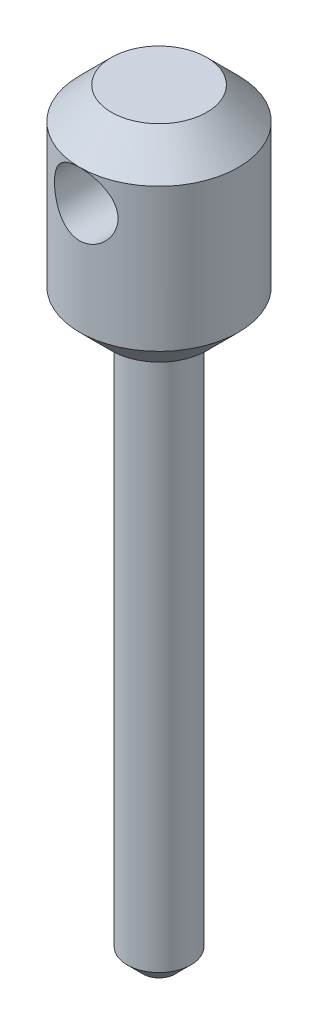
ISO-10303-21;
HEADER;
FILE_DESCRIPTION(('STEP AP214'),'2;1');
FILE_NAME('part.step','',(''),(''),'','','');
FILE_SCHEMA(('AUTOMOTIVE_DESIGN { 1 0 10303 214 1 1 1 1 }'));
ENDSEC;
DATA;
#1=APPLICATION_CONTEXT('core data for automotive mechanical design processes');
#2=APPLICATION_PROTOCOL_DEFINITION('international standard','automotive_design',2000,#1);
#3=PRODUCT_CONTEXT('',#1,'mechanical');
#4=PRODUCT('Part','Part','',(#3));
#5=PRODUCT_RELATED_PRODUCT_CATEGORY('part','',(#4));
#6=PRODUCT_DEFINITION_FORMATION('','',#4);
#7=PRODUCT_DEFINITION_CONTEXT('part definition',#1,'design');
#8=PRODUCT_DEFINITION('design','',#6,#7);
#9=PRODUCT_DEFINITION_SHAPE('','',#8);
#10=(LENGTH_UNIT() NAMED_UNIT(*) SI_UNIT(.MILLI.,.METRE.));
#11=(NAMED_UNIT(*) PLANE_ANGLE_UNIT() SI_UNIT($,.RADIAN.));
#12=(NAMED_UNIT(*) SI_UNIT($,.STERADIAN.) SOLID_ANGLE_UNIT());
#13=UNCERTAINTY_MEASURE_WITH_UNIT(LENGTH_MEASURE(1.E-05),#10,'distance_accuracy_value','');
#14=(GEOMETRIC_REPRESENTATION_CONTEXT(3) GLOBAL_UNCERTAINTY_ASSIGNED_CONTEXT((#13)) GLOBAL_UNIT_ASSIGNED_CONTEXT((#10,
#11,#12)) REPRESENTATION_CONTEXT('',''));
#15=CARTESIAN_POINT('',(0.,0.,0.));
#16=DIRECTION('',(0.,0.,1.));
#17=DIRECTION('',(1.,0.,0.));
#18=AXIS2_PLACEMENT_3D('',#15,#16,#17);
#19=CARTESIAN_POINT('',(0.,0.,0.));
#20=DIRECTION('',(0.,-1.,0.));
#21=DIRECTION('',(0.,0.,-1.));
#22=AXIS2_PLACEMENT_3D('',#19,#20,#21);
#23=PLANE('',#22);
#24=CARTESIAN_POINT('',(0.,0.,0.));
#25=DIRECTION('',(0.,-1.,0.));
#26=DIRECTION('',(0.,0.,-1.));
#27=AXIS2_PLACEMENT_3D('',#24,#25,#26);
#28=CIRCLE('',#27,1.);
#29=CARTESIAN_POINT('',(0.,0.,-1.));
#30=VERTEX_POINT('',#29);
#31=EDGE_CURVE('E11',#30,#30,#28,.T.);
#32=ORIENTED_EDGE('',*,*,#31,.T.);
#33=EDGE_LOOP('',(#32));
#34=FACE_BOUND('',#33,.T.);
#35=ADVANCED_FACE('F37',(#34),#23,.T.);
#36=CARTESIAN_POINT('',(0.,0.,0.));
#37=DIRECTION('',(0.,1.,0.));
#38=DIRECTION('',(0.,0.,1.));
#39=AXIS2_PLACEMENT_3D('',#36,#37,#38);
#40=CONICAL_SURFACE('',#39,1.,0.78539816339745);
#41=CARTESIAN_POINT('',(0.,0.999999999999997,0.));
#42=DIRECTION('',(0.,-1.,0.));
#43=DIRECTION('',(0.,0.,-1.));
#44=AXIS2_PLACEMENT_3D('',#41,#42,#43);
#45=CIRCLE('',#44,2.);
#46=CARTESIAN_POINT('',(0.,0.999999999999997,-2.));
#47=VERTEX_POINT('',#46);
#48=EDGE_CURVE('E44',#47,#47,#45,.T.);
#49=ORIENTED_EDGE('',*,*,#48,.T.);
#50=EDGE_LOOP('',(#49));
#51=FACE_BOUND('',#50,.T.);
#52=ORIENTED_EDGE('',*,*,#31,.F.);
#53=EDGE_LOOP('',(#52));
#54=FACE_BOUND('',#53,.T.);
#55=ADVANCED_FACE('F92',(#51,#54),#40,.T.);
#56=CARTESIAN_POINT('',(0.,0.,0.));
#57=DIRECTION('',(0.,-1.,0.));
#58=DIRECTION('',(0.,0.,-1.));
#59=AXIS2_PLACEMENT_3D('',#56,#57,#58);
#60=CYLINDRICAL_SURFACE('',#59,2.);
#61=CARTESIAN_POINT('',(0.,35.,0.));
#62=DIRECTION('',(0.,-1.,0.));
#63=DIRECTION('',(0.,0.,-1.));
#64=AXIS2_PLACEMENT_3D('',#61,#62,#63);
#65=CIRCLE('',#64,2.);
#66=CARTESIAN_POINT('',(0.,35.,-2.));
#67=VERTEX_POINT('',#66);
#68=EDGE_CURVE('E122',#67,#67,#65,.T.);
#69=ORIENTED_EDGE('',*,*,#68,.T.);
#70=EDGE_LOOP('',(#69));
#71=FACE_BOUND('',#70,.T.);
#72=ORIENTED_EDGE('',*,*,#48,.F.);
#73=EDGE_LOOP('',(#72));
#74=FACE_BOUND('',#73,.T.);
#75=ADVANCED_FACE('F97',(#71,#74),#60,.T.);
#76=CARTESIAN_POINT('',(2.,35.,0.));
#77=DIRECTION('',(0.,-1.,0.));
#78=DIRECTION('',(0.,0.,-1.));
#79=AXIS2_PLACEMENT_3D('',#76,#77,#78);
#80=PLANE('',#79);
#81=CARTESIAN_POINT('',(0.,35.,0.));
#82=DIRECTION('',(0.,-1.,0.));
#83=DIRECTION('',(0.,0.,-1.));
#84=AXIS2_PLACEMENT_3D('',#81,#82,#83);
#85=CIRCLE('',#84,3.);
#86=CARTESIAN_POINT('',(0.,35.,-3.));
#87=VERTEX_POINT('',#86);
#88=EDGE_CURVE('E121',#87,#87,#85,.T.);
#89=ORIENTED_EDGE('',*,*,#88,.T.);
#90=EDGE_LOOP('',(#89));
#91=FACE_BOUND('',#90,.T.);
#92=ORIENTED_EDGE('',*,*,#68,.F.);
#93=EDGE_LOOP('',(#92));
#94=FACE_BOUND('',#93,.T.);
#95=ADVANCED_FACE('F104',(#91,#94),#80,.T.);
#96=CARTESIAN_POINT('',(0.,35.,0.));
#97=DIRECTION('',(0.,1.,0.));
#98=DIRECTION('',(0.,0.,1.));
#99=AXIS2_PLACEMENT_3D('',#96,#97,#98);
#100=CONICAL_SURFACE('',#99,3.,0.78539816339745);
#101=CARTESIAN_POINT('',(0.,37.,0.));
#102=DIRECTION('',(0.,-1.,0.));
#103=DIRECTION('',(0.,0.,-1.));
#104=AXIS2_PLACEMENT_3D('',#101,#102,#103);
#105=CIRCLE('',#104,5.);
#106=CARTESIAN_POINT('',(0.,37.,-5.));
#107=VERTEX_POINT('',#106);
#108=EDGE_CURVE('E118',#107,#107,#105,.T.);
#109=ORIENTED_EDGE('',*,*,#108,.T.);
#110=EDGE_LOOP('',(#109));
#111=FACE_BOUND('',#110,.T.);
#112=ORIENTED_EDGE('',*,*,#88,.F.);
#113=EDGE_LOOP('',(#112));
#114=FACE_BOUND('',#113,.T.);
#115=ADVANCED_FACE('F88',(#111,#114),#100,.T.);
#116=CARTESIAN_POINT('',(0.,0.,0.));
#117=DIRECTION('',(0.,-1.,0.));
#118=DIRECTION('',(0.,0.,-1.));
#119=AXIS2_PLACEMENT_3D('',#116,#117,#118);
#120=CYLINDRICAL_SURFACE('',#119,5.);
#121=CARTESIAN_POINT('',(0.,46.,-5.));
#122=CARTESIAN_POINT('',(0.107493005442891,45.9999901481763,-4.99999271227085));
#123=CARTESIAN_POINT('',(0.215172564090672,45.9912822479116,-4.99649294306933));
#124=CARTESIAN_POINT('',(0.427496480417895,45.9567522964788,-4.98283453100642));
#125=CARTESIAN_POINT('',(0.532131777561248,45.9308837209139,-4.97265778698877));
#126=CARTESIAN_POINT('',(0.734953922727403,45.8631239219412,-4.94674209213118));
#127=CARTESIAN_POINT('',(0.833160661616959,45.8212851537833,-4.93102136364072));
#128=CARTESIAN_POINT('',(1.02107197032837,45.7229808266735,-4.89556610796078));
#129=CARTESIAN_POINT('',(1.11077947675099,45.6665203450811,-4.87583297458057));
#130=CARTESIAN_POINT('',(1.28350100757039,45.5377645014391,-4.83330886170419));
#131=CARTESIAN_POINT('',(1.36606227255022,45.4648933437597,-4.8104229692919));
#132=CARTESIAN_POINT('',(1.51817500478473,45.3065999965232,-4.76460576906194));
#133=CARTESIAN_POINT('',(1.58772010713353,45.2211717027883,-4.74167444453792));
#134=CARTESIAN_POINT('',(1.71487456729288,45.0355719297577,-4.69722791797136));
#135=CARTESIAN_POINT('',(1.77181498119547,44.9349135139768,-4.67582115964951));
#136=CARTESIAN_POINT('',(1.86775471903715,44.72446360158,-4.63833647186793));
#137=CARTESIAN_POINT('',(1.90676256428583,44.6146764721517,-4.62225601244176));
#138=CARTESIAN_POINT('',(1.96389882339587,44.3942876664079,-4.59826357660818));
#139=CARTESIAN_POINT('',(1.98289396580565,44.2839487644238,-4.59001420355605));
#140=CARTESIAN_POINT('',(2.00217296164003,44.0613650016927,-4.58164004049144));
#141=CARTESIAN_POINT('',(2.00246601631322,43.949121105375,-4.58151125522768));
#142=CARTESIAN_POINT('',(1.98498936750454,43.734243328542,-4.58910500279994));
#143=CARTESIAN_POINT('',(1.96847531430514,43.631484285591,-4.5962817503845));
#144=CARTESIAN_POINT('',(1.91994688029782,43.4303404439933,-4.61676187607836));
#145=CARTESIAN_POINT('',(1.88792979480463,43.3319564118897,-4.63006632321673));
#146=CARTESIAN_POINT('',(1.80869473255107,43.139982163804,-4.6615948508853));
#147=CARTESIAN_POINT('',(1.76117986231532,43.0465307609453,-4.67991379280788));
#148=CARTESIAN_POINT('',(1.65250646073221,42.8685841836384,-4.7193811638989));
#149=CARTESIAN_POINT('',(1.59134280510084,42.7840923905972,-4.74053065456848));
#150=CARTESIAN_POINT('',(1.45155059945443,42.619590271198,-4.78526736742271));
#151=CARTESIAN_POINT('',(1.37193746297063,42.540431270554,-4.80891664976152));
#152=CARTESIAN_POINT('',(1.20031442743019,42.396315521998,-4.85459824958282));
#153=CARTESIAN_POINT('',(1.10830206533443,42.3313616025897,-4.87663024445325));
#154=CARTESIAN_POINT('',(0.912077652605842,42.2163825525842,-4.91714681264548));
#155=CARTESIAN_POINT('',(0.807660491346475,42.166677718803,-4.93555270095415));
#156=CARTESIAN_POINT('',(0.59102376548288,42.0858321389219,-4.96614828328759));
#157=CARTESIAN_POINT('',(0.478808196849672,42.0546819624426,-4.97834113462382));
#158=CARTESIAN_POINT('',(0.256895887607819,42.0135517045803,-4.99456139506911));
#159=CARTESIAN_POINT('',(0.147443293985534,42.0024275457464,-4.99902945833514));
#160=CARTESIAN_POINT('',(-0.0718453098078167,41.9982868994714,-5.00068478510631));
#161=CARTESIAN_POINT('',(-0.181681213223923,42.0052657184525,-4.99787393582291));
#162=CARTESIAN_POINT('',(-0.393432739121986,42.036291752552,-4.98557567063753));
#163=CARTESIAN_POINT('',(-0.495482491775472,42.059557980351,-4.97639391345523));
#164=CARTESIAN_POINT('',(-0.694135428060779,42.1214357083098,-4.952594414055));
#165=CARTESIAN_POINT('',(-0.790737910224844,42.1600491796687,-4.9379759735653));
#166=CARTESIAN_POINT('',(-0.979078785816701,42.2527849396799,-4.90416594770812));
#167=CARTESIAN_POINT('',(-1.0705780227554,42.3073454720431,-4.88484815979804));
#168=CARTESIAN_POINT('',(-1.24344359124655,42.4299403239056,-4.84373364745525));
#169=CARTESIAN_POINT('',(-1.32480584076112,42.4979800429226,-4.8219359311027));
#170=CARTESIAN_POINT('',(-1.48072304302882,42.6508700129496,-4.77645117638112));
#171=CARTESIAN_POINT('',(-1.55447393380606,42.7365335415062,-4.75273441425052));
#172=CARTESIAN_POINT('',(-1.68675119741371,42.9194400830094,-4.70741672917132));
#173=CARTESIAN_POINT('',(-1.74527506133751,43.0166850003399,-4.68581615526511));
#174=CARTESIAN_POINT('',(-1.84580750193163,43.2214616945941,-4.64714299907708));
#175=CARTESIAN_POINT('',(-1.88765059453446,43.3290839992123,-4.63011630884788));
#176=CARTESIAN_POINT('',(-1.95229621970531,43.5507336517152,-4.60323673477931));
#177=CARTESIAN_POINT('',(-1.97511280526932,43.6647562058124,-4.59337855695998));
#178=CARTESIAN_POINT('',(-1.9997156172784,43.8871279017745,-4.58271759299926));
#179=CARTESIAN_POINT('',(-2.00289708230287,43.9952948395934,-4.58131421008171));
#180=CARTESIAN_POINT('',(-1.99180315927752,44.2105448577133,-4.58614836033098));
#181=CARTESIAN_POINT('',(-1.97752998791378,44.3176280739026,-4.59238492324793));
#182=CARTESIAN_POINT('',(-1.93307136615365,44.523332189855,-4.61126649079021));
#183=CARTESIAN_POINT('',(-1.90353749357098,44.622120274433,-4.62364831827449));
#184=CARTESIAN_POINT('',(-1.83000544849101,44.8133786296135,-4.65324001232696));
#185=CARTESIAN_POINT('',(-1.78600328139381,44.9058471468998,-4.67045121206007));
#186=CARTESIAN_POINT('',(-1.68187276275973,45.0876096192708,-4.70898609604492));
#187=CARTESIAN_POINT('',(-1.62096533515949,45.1764186701305,-4.73048882313242));
#188=CARTESIAN_POINT('',(-1.48589211927149,45.3429933172038,-4.77463804372237));
#189=CARTESIAN_POINT('',(-1.41172233481812,45.4207555721283,-4.79728488048406));
#190=CARTESIAN_POINT('',(-1.24650550627246,45.5682028532636,-4.84293567087394));
#191=CARTESIAN_POINT('',(-1.15467600114614,45.6370373068981,-4.86586757962185));
#192=CARTESIAN_POINT('',(-0.95990032028578,45.7583370426216,-4.90800406713717));
#193=CARTESIAN_POINT('',(-0.856949004547238,45.8107947121525,-4.92720691092906));
#194=CARTESIAN_POINT('',(-0.644738062495204,45.8966222151903,-4.95939714815861));
#195=CARTESIAN_POINT('',(-0.535631618219697,45.9303293235603,-4.97249363055028));
#196=CARTESIAN_POINT('',(-0.31287654628122,45.9786391209543,-4.99144306209366));
#197=CARTESIAN_POINT('',(-0.199243525858911,45.9933024367439,-4.99731899495638));
#198=CARTESIAN_POINT('',(-0.0569122978909282,45.9993953809783,-4.99975899504136));
#199=CARTESIAN_POINT('',(-0.0284626887407577,46.0000026086292,-5.00000192969176));
#200=CARTESIAN_POINT('',(0.,46.,-5.));
#201=B_SPLINE_CURVE_WITH_KNOTS('',3,(#121,#122,#123,#124,#125,#126,#127,#128,#129,#130,#131,
#132,#133,#134,#135,#136,#137,#138,#139,#140,#141,#142,#143,#144,#145,#146,#147,#148,#149,#150,
#151,#152,#153,#154,#155,#156,#157,#158,#159,#160,#161,#162,#163,#164,#165,#166,#167,#168,#169,
#170,#171,#172,#173,#174,#175,#176,#177,#178,#179,#180,#181,#182,#183,#184,#185,#186,#187,#188,
#189,#190,#191,#192,#193,#194,#195,#196,#197,#198,#199,#200),.UNSPECIFIED.,.T.,.F.,(4,2,2,2,2,2,
2,2,2,2,2,2,2,2,2,2,2,2,2,2,2,2,2,2,2,2,2,2,2,2,2,2,2,2,2,2,2,2,2,4),(0.,0.32240298789307,
0.645683636007934,0.96791145747158,1.29002753567984,1.62597381700397,1.96208394934412,
2.31315258819217,2.66405423118268,2.99904105308829,3.33386306340489,3.64538328401372,
3.95695787256048,4.27489126298816,4.59294421938184,4.93558349186558,5.27829092839733,
5.62776913162807,5.97706956113791,6.30569184528008,6.63422893570082,6.94800455564365,
7.26182048993797,7.58523513398262,7.90877959498969,8.25368474624413,8.59864669043749,
8.94695045140829,9.29499672645934,9.61799673392748,9.94095572563046,10.2511431854877,
10.5614163580516,10.8894546805669,11.2175920134839,11.5670042353384,11.9165786364053,
12.2596430101332,12.6016125240434,12.686980458968),.UNSPECIFIED.);
#202=CARTESIAN_POINT('',(0.,46.,-5.));
#203=VERTEX_POINT('',#202);
#204=EDGE_CURVE('E49',#203,#203,#201,.T.);
#205=ORIENTED_EDGE('',*,*,#204,.F.);
#206=CARTESIAN_POINT('',(0.,46.,0.));
#207=DIRECTION('',(0.,-1.,0.));
#208=DIRECTION('',(0.,0.,-1.));
#209=AXIS2_PLACEMENT_3D('',#206,#207,#208);
#210=CIRCLE('',#209,5.);
#211=CARTESIAN_POINT('',(0.,46.,5.));
#212=VERTEX_POINT('',#211);
#213=EDGE_CURVE('E126',#203,#212,#210,.T.);
#214=ORIENTED_EDGE('',*,*,#213,.T.);
#215=CARTESIAN_POINT('',(0.,46.,5.));
#216=CARTESIAN_POINT('',(-0.107493005442891,45.9999901481763,4.99999271227085));
#217=CARTESIAN_POINT('',(-0.215172564090672,45.9912822479116,4.99649294306933));
#218=CARTESIAN_POINT('',(-0.427496480417895,45.9567522964788,4.98283453100642));
#219=CARTESIAN_POINT('',(-0.532131777561248,45.9308837209139,4.97265778698877));
#220=CARTESIAN_POINT('',(-0.734953922727403,45.8631239219412,4.94674209213118));
#221=CARTESIAN_POINT('',(-0.833160661616959,45.8212851537833,4.93102136364072));
#222=CARTESIAN_POINT('',(-1.02107197032837,45.7229808266735,4.89556610796078));
#223=CARTESIAN_POINT('',(-1.11077947675099,45.6665203450811,4.87583297458057));
#224=CARTESIAN_POINT('',(-1.28350100757039,45.5377645014391,4.83330886170419));
#225=CARTESIAN_POINT('',(-1.36606227255022,45.4648933437597,4.8104229692919));
#226=CARTESIAN_POINT('',(-1.51817500478473,45.3065999965232,4.76460576906194));
#227=CARTESIAN_POINT('',(-1.58772010713353,45.2211717027883,4.74167444453792));
#228=CARTESIAN_POINT('',(-1.71487456729288,45.0355719297577,4.69722791797136));
#229=CARTESIAN_POINT('',(-1.77181498119547,44.9349135139768,4.67582115964951));
#230=CARTESIAN_POINT('',(-1.86775471903715,44.72446360158,4.63833647186793));
#231=CARTESIAN_POINT('',(-1.90676256428583,44.6146764721517,4.62225601244176));
#232=CARTESIAN_POINT('',(-1.96389882339587,44.3942876664079,4.59826357660818));
#233=CARTESIAN_POINT('',(-1.98289396580565,44.2839487644238,4.59001420355605));
#234=CARTESIAN_POINT('',(-2.00217296164003,44.0613650016927,4.58164004049144));
#235=CARTESIAN_POINT('',(-2.00246601631322,43.949121105375,4.58151125522768));
#236=CARTESIAN_POINT('',(-1.98498936750454,43.734243328542,4.58910500279994));
#237=CARTESIAN_POINT('',(-1.96847531430514,43.631484285591,4.5962817503845));
#238=CARTESIAN_POINT('',(-1.91994688029782,43.4303404439933,4.61676187607836));
#239=CARTESIAN_POINT('',(-1.88792979480463,43.3319564118897,4.63006632321673));
#240=CARTESIAN_POINT('',(-1.80869473255107,43.139982163804,4.6615948508853));
#241=CARTESIAN_POINT('',(-1.76117986231532,43.0465307609453,4.67991379280788));
#242=CARTESIAN_POINT('',(-1.65250646073221,42.8685841836384,4.7193811638989));
#243=CARTESIAN_POINT('',(-1.59134280510084,42.7840923905972,4.74053065456848));
#244=CARTESIAN_POINT('',(-1.45155059945443,42.619590271198,4.78526736742271));
#245=CARTESIAN_POINT('',(-1.37193746297063,42.540431270554,4.80891664976152));
#246=CARTESIAN_POINT('',(-1.20031442743019,42.396315521998,4.85459824958282));
#247=CARTESIAN_POINT('',(-1.10830206533443,42.3313616025897,4.87663024445325));
#248=CARTESIAN_POINT('',(-0.912077652605842,42.2163825525842,4.91714681264548));
#249=CARTESIAN_POINT('',(-0.807660491346475,42.166677718803,4.93555270095415));
#250=CARTESIAN_POINT('',(-0.59102376548288,42.0858321389219,4.96614828328759));
#251=CARTESIAN_POINT('',(-0.478808196849672,42.0546819624426,4.97834113462382));
#252=CARTESIAN_POINT('',(-0.256895887607819,42.0135517045803,4.99456139506911));
#253=CARTESIAN_POINT('',(-0.147443293985534,42.0024275457464,4.99902945833514));
#254=CARTESIAN_POINT('',(0.0718453098078167,41.9982868994714,5.00068478510631));
#255=CARTESIAN_POINT('',(0.181681213223923,42.0052657184525,4.99787393582291));
#256=CARTESIAN_POINT('',(0.393432739121986,42.036291752552,4.98557567063753));
#257=CARTESIAN_POINT('',(0.495482491775472,42.059557980351,4.97639391345523));
#258=CARTESIAN_POINT('',(0.694135428060779,42.1214357083098,4.952594414055));
#259=CARTESIAN_POINT('',(0.790737910224844,42.1600491796687,4.9379759735653));
#260=CARTESIAN_POINT('',(0.979078785816701,42.2527849396799,4.90416594770812));
#261=CARTESIAN_POINT('',(1.0705780227554,42.3073454720431,4.88484815979804));
#262=CARTESIAN_POINT('',(1.24344359124655,42.4299403239056,4.84373364745525));
#263=CARTESIAN_POINT('',(1.32480584076112,42.4979800429226,4.8219359311027));
#264=CARTESIAN_POINT('',(1.48072304302882,42.6508700129496,4.77645117638112));
#265=CARTESIAN_POINT('',(1.55447393380606,42.7365335415062,4.75273441425052));
#266=CARTESIAN_POINT('',(1.68675119741371,42.9194400830094,4.70741672917132));
#267=CARTESIAN_POINT('',(1.74527506133751,43.0166850003399,4.68581615526511));
#268=CARTESIAN_POINT('',(1.84580750193163,43.2214616945941,4.64714299907708));
#269=CARTESIAN_POINT('',(1.88765059453446,43.3290839992123,4.63011630884788));
#270=CARTESIAN_POINT('',(1.95229621970531,43.5507336517152,4.60323673477931));
#271=CARTESIAN_POINT('',(1.97511280526932,43.6647562058124,4.59337855695998));
#272=CARTESIAN_POINT('',(1.9997156172784,43.8871279017745,4.58271759299926));
#273=CARTESIAN_POINT('',(2.00289708230287,43.9952948395934,4.58131421008171));
#274=CARTESIAN_POINT('',(1.99180315927752,44.2105448577133,4.58614836033098));
#275=CARTESIAN_POINT('',(1.97752998791378,44.3176280739026,4.59238492324793));
#276=CARTESIAN_POINT('',(1.93307136615365,44.523332189855,4.61126649079021));
#277=CARTESIAN_POINT('',(1.90353749357098,44.622120274433,4.62364831827449));
#278=CARTESIAN_POINT('',(1.83000544849101,44.8133786296135,4.65324001232696));
#279=CARTESIAN_POINT('',(1.78600328139381,44.9058471468998,4.67045121206007));
#280=CARTESIAN_POINT('',(1.68187276275973,45.0876096192708,4.70898609604492));
#281=CARTESIAN_POINT('',(1.62096533515949,45.1764186701305,4.73048882313242));
#282=CARTESIAN_POINT('',(1.48589211927149,45.3429933172038,4.77463804372237));
#283=CARTESIAN_POINT('',(1.41172233481812,45.4207555721283,4.79728488048406));
#284=CARTESIAN_POINT('',(1.24650550627246,45.5682028532636,4.84293567087394));
#285=CARTESIAN_POINT('',(1.15467600114614,45.6370373068981,4.86586757962185));
#286=CARTESIAN_POINT('',(0.95990032028578,45.7583370426216,4.90800406713717));
#287=CARTESIAN_POINT('',(0.856949004547238,45.8107947121525,4.92720691092906));
#288=CARTESIAN_POINT('',(0.644738062495204,45.8966222151903,4.95939714815861));
#289=CARTESIAN_POINT('',(0.535631618219697,45.9303293235603,4.97249363055028));
#290=CARTESIAN_POINT('',(0.31287654628122,45.9786391209543,4.99144306209366));
#291=CARTESIAN_POINT('',(0.199243525858911,45.9933024367439,4.99731899495638));
#292=CARTESIAN_POINT('',(0.0569122978909282,45.9993953809783,4.99975899504136));
#293=CARTESIAN_POINT('',(0.0284626887407577,46.0000026086292,5.00000192969176));
#294=CARTESIAN_POINT('',(0.,46.,5.));
#295=B_SPLINE_CURVE_WITH_KNOTS('',3,(#215,#216,#217,#218,#219,#220,#221,#222,#223,#224,#225,
#226,#227,#228,#229,#230,#231,#232,#233,#234,#235,#236,#237,#238,#239,#240,#241,#242,#243,#244,
#245,#246,#247,#248,#249,#250,#251,#252,#253,#254,#255,#256,#257,#258,#259,#260,#261,#262,#263,
#264,#265,#266,#267,#268,#269,#270,#271,#272,#273,#274,#275,#276,#277,#278,#279,#280,#281,#282,
#283,#284,#285,#286,#287,#288,#289,#290,#291,#292,#293,#294),.UNSPECIFIED.,.T.,.F.,(4,2,2,2,2,2,
2,2,2,2,2,2,2,2,2,2,2,2,2,2,2,2,2,2,2,2,2,2,2,2,2,2,2,2,2,2,2,2,2,4),(0.,0.32240298789307,
0.645683636007934,0.96791145747158,1.29002753567984,1.62597381700397,1.96208394934412,
2.31315258819217,2.66405423118268,2.99904105308829,3.33386306340489,3.64538328401372,
3.95695787256048,4.27489126298816,4.59294421938184,4.93558349186558,5.27829092839733,
5.62776913162807,5.97706956113791,6.30569184528008,6.63422893570082,6.94800455564365,
7.26182048993797,7.58523513398262,7.90877959498969,8.25368474624413,8.59864669043749,
8.94695045140829,9.29499672645934,9.61799673392748,9.94095572563046,10.2511431854877,
10.5614163580516,10.8894546805669,11.2175920134839,11.5670042353384,11.9165786364053,
12.2596430101332,12.6016125240434,12.686980458968),.UNSPECIFIED.);
#296=EDGE_CURVE('E53',#212,#212,#295,.T.);
#297=ORIENTED_EDGE('',*,*,#296,.F.);
#298=EDGE_CURVE('E131',#212,#203,#210,.T.);
#299=ORIENTED_EDGE('',*,*,#298,.T.);
#300=EDGE_LOOP('',(#205,#214,#297,#299));
#301=FACE_BOUND('',#300,.T.);
#302=ORIENTED_EDGE('',*,*,#108,.F.);
#303=EDGE_LOOP('',(#302));
#304=FACE_BOUND('',#303,.T.);
#305=ADVANCED_FACE('F71',(#301,#304),#120,.T.);
#306=CARTESIAN_POINT('',(0.,46.,0.));
#307=DIRECTION('',(0.,-1.,0.));
#308=DIRECTION('',(0.,0.,-1.));
#309=AXIS2_PLACEMENT_3D('',#306,#307,#308);
#310=CONICAL_SURFACE('',#309,5.,0.78539816339745);
#311=CARTESIAN_POINT('',(0.,48.,0.));
#312=DIRECTION('',(0.,-1.,0.));
#313=DIRECTION('',(0.,0.,-1.));
#314=AXIS2_PLACEMENT_3D('',#311,#312,#313);
#315=CIRCLE('',#314,3.);
#316=CARTESIAN_POINT('',(0.,48.,-3.));
#317=VERTEX_POINT('',#316);
#318=EDGE_CURVE('E60',#317,#317,#315,.T.);
#319=ORIENTED_EDGE('',*,*,#318,.T.);
#320=EDGE_LOOP('',(#319));
#321=FACE_BOUND('',#320,.T.);
#322=ORIENTED_EDGE('',*,*,#213,.F.);
#323=ORIENTED_EDGE('',*,*,#298,.F.);
#324=EDGE_LOOP('',(#322,#323));
#325=FACE_BOUND('',#324,.T.);
#326=ADVANCED_FACE('F81',(#321,#325),#310,.T.);
#327=CARTESIAN_POINT('',(3.,48.,0.));
#328=DIRECTION('',(0.,1.,0.));
#329=DIRECTION('',(0.,0.,1.));
#330=AXIS2_PLACEMENT_3D('',#327,#328,#329);
#331=PLANE('',#330);
#332=ORIENTED_EDGE('',*,*,#318,.F.);
#333=EDGE_LOOP('',(#332));
#334=FACE_BOUND('',#333,.T.);
#335=ADVANCED_FACE('F78',(#334),#331,.T.);
#336=CARTESIAN_POINT('',(0.,44.,-5.));
#337=DIRECTION('',(0.,0.,1.));
#338=DIRECTION('',(1.,0.,0.));
#339=AXIS2_PLACEMENT_3D('',#336,#337,#338);
#340=CYLINDRICAL_SURFACE('',#339,2.);
#341=ORIENTED_EDGE('',*,*,#204,.T.);
#342=EDGE_LOOP('',(#341));
#343=FACE_BOUND('',#342,.T.);
#344=ORIENTED_EDGE('',*,*,#296,.T.);
#345=EDGE_LOOP('',(#344));
#346=FACE_BOUND('',#345,.T.);
#347=ADVANCED_FACE('F54',(#343,#346),#340,.F.);
#348=CLOSED_SHELL('',(#35,#55,#75,#95,#115,#305,#326,#335,#347));
#349=MANIFOLD_SOLID_BREP('B2',#348);
#350=ADVANCED_BREP_SHAPE_REPRESENTATION('',(#18,#349),#14);
#351=SHAPE_DEFINITION_REPRESENTATION(#9,#350);
ENDSEC;
END-ISO-10303-21;
